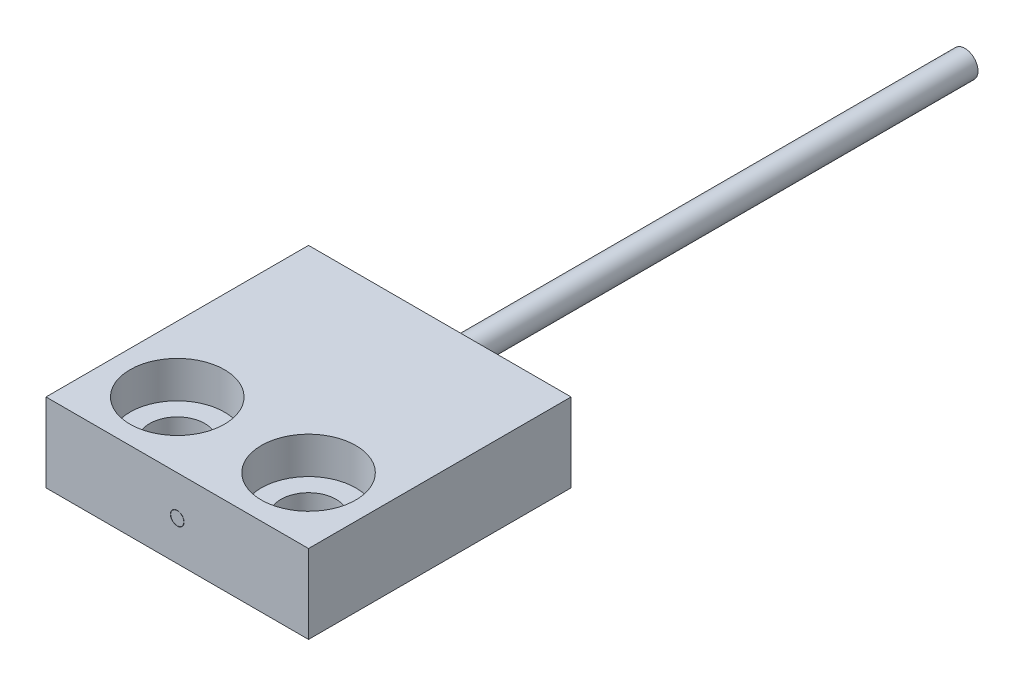
ISO-10303-21;
HEADER;
FILE_DESCRIPTION(('STEP AP214'),'2;1');
FILE_NAME('part.step','',(''),(''),'','','');
FILE_SCHEMA(('AUTOMOTIVE_DESIGN { 1 0 10303 214 1 1 1 1 }'));
ENDSEC;
DATA;
#1=APPLICATION_CONTEXT('core data for automotive mechanical design processes');
#2=APPLICATION_PROTOCOL_DEFINITION('international standard','automotive_design',2000,#1);
#3=PRODUCT_CONTEXT('',#1,'mechanical');
#4=PRODUCT('Part','Part','',(#3));
#5=PRODUCT_RELATED_PRODUCT_CATEGORY('part','',(#4));
#6=PRODUCT_DEFINITION_FORMATION('','',#4);
#7=PRODUCT_DEFINITION_CONTEXT('part definition',#1,'design');
#8=PRODUCT_DEFINITION('design','',#6,#7);
#9=PRODUCT_DEFINITION_SHAPE('','',#8);
#10=(LENGTH_UNIT() NAMED_UNIT(*) SI_UNIT(.MILLI.,.METRE.));
#11=(NAMED_UNIT(*) PLANE_ANGLE_UNIT() SI_UNIT($,.RADIAN.));
#12=(NAMED_UNIT(*) SI_UNIT($,.STERADIAN.) SOLID_ANGLE_UNIT());
#13=UNCERTAINTY_MEASURE_WITH_UNIT(LENGTH_MEASURE(1.E-05),#10,'distance_accuracy_value','');
#14=(GEOMETRIC_REPRESENTATION_CONTEXT(3) GLOBAL_UNCERTAINTY_ASSIGNED_CONTEXT((#13)) GLOBAL_UNIT_ASSIGNED_CONTEXT((#10,
#11,#12)) REPRESENTATION_CONTEXT('',''));
#15=CARTESIAN_POINT('',(0.,0.,0.));
#16=DIRECTION('',(0.,0.,1.));
#17=DIRECTION('',(1.,0.,0.));
#18=AXIS2_PLACEMENT_3D('',#15,#16,#17);
#19=CARTESIAN_POINT('',(-10.,1.50000000000004,0.));
#20=DIRECTION('',(0.,0.,1.));
#21=DIRECTION('',(0.,-1.,0.));
#22=AXIS2_PLACEMENT_3D('',#19,#20,#21);
#23=PLANE('',#22);
#24=CARTESIAN_POINT('',(-15.,0.,0.));
#25=DIRECTION('',(0.,0.,1.));
#26=DIRECTION('',(1.,0.,0.));
#27=AXIS2_PLACEMENT_3D('',#24,#25,#26);
#28=CIRCLE('',#27,0.25);
#29=CARTESIAN_POINT('',(-14.75,0.,0.));
#30=VERTEX_POINT('',#29);
#31=EDGE_CURVE('E21',#30,#30,#28,.F.);
#32=ORIENTED_EDGE('',*,*,#31,.F.);
#33=EDGE_LOOP('',(#32));
#34=FACE_BOUND('',#33,.T.);
#35=ADVANCED_FACE('F17',(#34),#23,.T.);
#36=CARTESIAN_POINT('',(-15.,0.,-10.735391052434));
#37=DIRECTION('',(0.,0.,1.));
#38=DIRECTION('',(1.,0.,0.));
#39=AXIS2_PLACEMENT_3D('',#36,#37,#38);
#40=CYLINDRICAL_SURFACE('',#39,0.25);
#41=ORIENTED_EDGE('',*,*,#31,.T.);
#42=EDGE_LOOP('',(#41));
#43=FACE_BOUND('',#42,.T.);
#44=CARTESIAN_POINT('',(-15.,0.,-10.));
#45=DIRECTION('',(0.,0.,1.));
#46=DIRECTION('',(1.,0.,0.));
#47=AXIS2_PLACEMENT_3D('',#44,#45,#46);
#48=CIRCLE('',#47,0.25);
#49=CARTESIAN_POINT('',(-14.75,0.,-10.));
#50=VERTEX_POINT('',#49);
#51=EDGE_CURVE('E128',#50,#50,#48,.T.);
#52=ORIENTED_EDGE('',*,*,#51,.T.);
#53=EDGE_LOOP('',(#52));
#54=FACE_BOUND('',#53,.T.);
#55=ADVANCED_FACE('F135',(#43,#54),#40,.T.);
#56=CARTESIAN_POINT('',(-20.,1.49999999999994,-10.));
#57=DIRECTION('',(0.,0.,-1.));
#58=DIRECTION('',(0.,1.,0.));
#59=AXIS2_PLACEMENT_3D('',#56,#57,#58);
#60=PLANE('',#59);
#61=CARTESIAN_POINT('',(-15.,0.,-10.));
#62=DIRECTION('',(0.,0.,1.));
#63=DIRECTION('',(1.,0.,0.));
#64=AXIS2_PLACEMENT_3D('',#61,#62,#63);
#65=CIRCLE('',#64,0.26);
#66=CARTESIAN_POINT('',(-14.74,0.,-10.));
#67=VERTEX_POINT('',#66);
#68=EDGE_CURVE('E123',#67,#67,#65,.T.);
#69=ORIENTED_EDGE('',*,*,#68,.T.);
#70=EDGE_LOOP('',(#69));
#71=FACE_BOUND('',#70,.T.);
#72=ORIENTED_EDGE('',*,*,#51,.F.);
#73=EDGE_LOOP('',(#72));
#74=FACE_BOUND('',#73,.T.);
#75=ADVANCED_FACE('F143',(#71,#74),#60,.F.);
#76=CARTESIAN_POINT('',(-12.5,0.100000000000017,-2.5));
#77=DIRECTION('',(0.,1.,0.));
#78=DIRECTION('',(-1.,0.,0.));
#79=AXIS2_PLACEMENT_3D('',#76,#77,#78);
#80=CYLINDRICAL_SURFACE('',#79,1.8);
#81=CARTESIAN_POINT('',(-12.5,0.100000000000017,-2.5));
#82=DIRECTION('',(0.,1.,0.));
#83=DIRECTION('',(-1.,0.,0.));
#84=AXIS2_PLACEMENT_3D('',#81,#82,#83);
#85=CIRCLE('',#84,1.8);
#86=CARTESIAN_POINT('',(-14.3,0.100000000000005,-2.5));
#87=VERTEX_POINT('',#86);
#88=EDGE_CURVE('E126',#87,#87,#85,.T.);
#89=ORIENTED_EDGE('',*,*,#88,.F.);
#90=EDGE_LOOP('',(#89));
#91=FACE_BOUND('',#90,.T.);
#92=CARTESIAN_POINT('',(-12.5,1.50000000000002,-2.50000000000001));
#93=DIRECTION('',(0.,1.,0.));
#94=DIRECTION('',(-1.,0.,0.));
#95=AXIS2_PLACEMENT_3D('',#92,#93,#94);
#96=CIRCLE('',#95,1.8);
#97=CARTESIAN_POINT('',(-14.3,1.50000000000001,-2.50000000000001));
#98=VERTEX_POINT('',#97);
#99=EDGE_CURVE('E117',#98,#98,#96,.T.);
#100=ORIENTED_EDGE('',*,*,#99,.T.);
#101=EDGE_LOOP('',(#100));
#102=FACE_BOUND('',#101,.T.);
#103=ADVANCED_FACE('F210',(#91,#102),#80,.F.);
#104=CARTESIAN_POINT('',(-15.,-1.04744500833281E-13,-30.));
#105=DIRECTION('',(0.,0.,-1.));
#106=DIRECTION('',(0.,1.,0.));
#107=AXIS2_PLACEMENT_3D('',#104,#105,#106);
#108=PLANE('',#107);
#109=CARTESIAN_POINT('',(-15.,0.,-30.));
#110=DIRECTION('',(0.,0.,1.));
#111=DIRECTION('',(0.,-1.,0.));
#112=AXIS2_PLACEMENT_3D('',#109,#110,#111);
#113=CIRCLE('',#112,0.5);
#114=CARTESIAN_POINT('',(-15.,-0.500000000000096,-30.));
#115=VERTEX_POINT('',#114);
#116=EDGE_CURVE('E114',#115,#115,#113,.T.);
#117=ORIENTED_EDGE('',*,*,#116,.F.);
#118=EDGE_LOOP('',(#117));
#119=FACE_BOUND('',#118,.T.);
#120=ADVANCED_FACE('F206',(#119),#108,.T.);
#121=CARTESIAN_POINT('',(-17.5,0.0999999999999824,-2.5));
#122=DIRECTION('',(0.,1.,0.));
#123=DIRECTION('',(-1.,0.,0.));
#124=AXIS2_PLACEMENT_3D('',#121,#122,#123);
#125=CYLINDRICAL_SURFACE('',#124,1.8);
#126=CARTESIAN_POINT('',(-17.5,1.49999999999998,-2.50000000000001));
#127=DIRECTION('',(0.,1.,0.));
#128=DIRECTION('',(-1.,0.,0.));
#129=AXIS2_PLACEMENT_3D('',#126,#127,#128);
#130=CIRCLE('',#129,1.8);
#131=CARTESIAN_POINT('',(-19.3,1.49999999999997,-2.50000000000001));
#132=VERTEX_POINT('',#131);
#133=EDGE_CURVE('E120',#132,#132,#130,.T.);
#134=ORIENTED_EDGE('',*,*,#133,.T.);
#135=EDGE_LOOP('',(#134));
#136=FACE_BOUND('',#135,.T.);
#137=CARTESIAN_POINT('',(-17.5,0.0999999999999824,-2.5));
#138=DIRECTION('',(0.,1.,0.));
#139=DIRECTION('',(-1.,0.,0.));
#140=AXIS2_PLACEMENT_3D('',#137,#138,#139);
#141=CIRCLE('',#140,1.8);
#142=CARTESIAN_POINT('',(-19.3,0.0999999999999699,-2.5));
#143=VERTEX_POINT('',#142);
#144=EDGE_CURVE('E111',#143,#143,#141,.T.);
#145=ORIENTED_EDGE('',*,*,#144,.F.);
#146=EDGE_LOOP('',(#145));
#147=FACE_BOUND('',#146,.T.);
#148=ADVANCED_FACE('F202',(#136,#147),#125,.F.);
#149=CARTESIAN_POINT('',(-12.5,0.100000000000017,-2.5));
#150=DIRECTION('',(0.,1.,0.));
#151=DIRECTION('',(-1.,0.,0.));
#152=AXIS2_PLACEMENT_3D('',#149,#150,#151);
#153=PLANE('',#152);
#154=CARTESIAN_POINT('',(-12.5,0.100000000000017,-2.5));
#155=DIRECTION('',(0.,-1.,0.));
#156=DIRECTION('',(1.,0.,0.));
#157=AXIS2_PLACEMENT_3D('',#154,#155,#156);
#158=CIRCLE('',#157,1.05);
#159=CARTESIAN_POINT('',(-11.45,0.100000000000025,-2.5));
#160=VERTEX_POINT('',#159);
#161=EDGE_CURVE('E77',#160,#160,#158,.T.);
#162=ORIENTED_EDGE('',*,*,#161,.T.);
#163=EDGE_LOOP('',(#162));
#164=FACE_BOUND('',#163,.T.);
#165=ORIENTED_EDGE('',*,*,#88,.T.);
#166=EDGE_LOOP('',(#165));
#167=FACE_BOUND('',#166,.T.);
#168=ADVANCED_FACE('F198',(#164,#167),#153,.T.);
#169=CARTESIAN_POINT('',(-15.,0.,-10.735391052434));
#170=DIRECTION('',(0.,0.,1.));
#171=DIRECTION('',(1.,0.,0.));
#172=AXIS2_PLACEMENT_3D('',#169,#170,#171);
#173=CYLINDRICAL_SURFACE('',#172,0.26);
#174=ORIENTED_EDGE('',*,*,#68,.F.);
#175=EDGE_LOOP('',(#174));
#176=FACE_BOUND('',#175,.T.);
#177=CARTESIAN_POINT('',(-15.,0.,0.));
#178=DIRECTION('',(0.,0.,1.));
#179=DIRECTION('',(1.,0.,0.));
#180=AXIS2_PLACEMENT_3D('',#177,#178,#179);
#181=CIRCLE('',#180,0.26);
#182=CARTESIAN_POINT('',(-14.74,0.,0.));
#183=VERTEX_POINT('',#182);
#184=EDGE_CURVE('E82',#183,#183,#181,.F.);
#185=ORIENTED_EDGE('',*,*,#184,.F.);
#186=EDGE_LOOP('',(#185));
#187=FACE_BOUND('',#186,.T.);
#188=ADVANCED_FACE('F192',(#176,#187),#173,.F.);
#189=CARTESIAN_POINT('',(-20.,1.49999999999994,-10.));
#190=DIRECTION('',(0.,-1.,0.));
#191=DIRECTION('',(1.,0.,0.));
#192=AXIS2_PLACEMENT_3D('',#189,#190,#191);
#193=PLANE('',#192);
#194=ORIENTED_EDGE('',*,*,#99,.F.);
#195=EDGE_LOOP('',(#194));
#196=FACE_BOUND('',#195,.T.);
#197=ORIENTED_EDGE('',*,*,#133,.F.);
#198=EDGE_LOOP('',(#197));
#199=FACE_BOUND('',#198,.T.);
#200=DIRECTION('',(0.,0.,1.));
#201=VECTOR('',#200,1.);
#202=CARTESIAN_POINT('',(-10.,1.49999999999999,-10.));
#203=LINE('',#202,#201);
#204=CARTESIAN_POINT('',(-10.,1.49999999999999,-10.));
#205=VERTEX_POINT('',#204);
#206=CARTESIAN_POINT('',(-10.,1.50000000000003,0.));
#207=VERTEX_POINT('',#206);
#208=EDGE_CURVE('E57',#205,#207,#203,.T.);
#209=ORIENTED_EDGE('',*,*,#208,.F.);
#210=DIRECTION('',(1.,0.,0.));
#211=VECTOR('',#210,1.);
#212=CARTESIAN_POINT('',(-20.,1.49999999999996,-10.));
#213=LINE('',#212,#211);
#214=CARTESIAN_POINT('',(-20.,1.49999999999995,-10.));
#215=VERTEX_POINT('',#214);
#216=EDGE_CURVE('E61',#215,#205,#213,.T.);
#217=ORIENTED_EDGE('',*,*,#216,.F.);
#218=DIRECTION('',(0.,0.,1.));
#219=VECTOR('',#218,1.);
#220=CARTESIAN_POINT('',(-20.,1.49999999999998,0.));
#221=LINE('',#220,#219);
#222=CARTESIAN_POINT('',(-20.,1.49999999999999,0.));
#223=VERTEX_POINT('',#222);
#224=EDGE_CURVE('E68',#223,#215,#221,.F.);
#225=ORIENTED_EDGE('',*,*,#224,.F.);
#226=DIRECTION('',(1.,0.,0.));
#227=VECTOR('',#226,1.);
#228=CARTESIAN_POINT('',(-10.,1.50000000000003,0.));
#229=LINE('',#228,#227);
#230=EDGE_CURVE('E66',#207,#223,#229,.F.);
#231=ORIENTED_EDGE('',*,*,#230,.F.);
#232=EDGE_LOOP('',(#209,#217,#225,#231));
#233=FACE_BOUND('',#232,.T.);
#234=ADVANCED_FACE('F67',(#196,#199,#233),#193,.F.);
#235=CARTESIAN_POINT('',(-15.,-3.75334461319259E-13,-110.));
#236=DIRECTION('',(0.,0.,1.));
#237=DIRECTION('',(0.,-1.,0.));
#238=AXIS2_PLACEMENT_3D('',#235,#236,#237);
#239=CYLINDRICAL_SURFACE('',#238,0.5);
#240=ORIENTED_EDGE('',*,*,#116,.T.);
#241=EDGE_LOOP('',(#240));
#242=FACE_BOUND('',#241,.T.);
#243=CARTESIAN_POINT('',(-15.,0.,-9.99999999999999));
#244=DIRECTION('',(0.,0.,1.));
#245=DIRECTION('',(0.,-1.,0.));
#246=AXIS2_PLACEMENT_3D('',#243,#244,#245);
#247=CIRCLE('',#246,0.5);
#248=CARTESIAN_POINT('',(-15.,-0.500000000000026,-9.99999999999999));
#249=VERTEX_POINT('',#248);
#250=EDGE_CURVE('E91',#249,#249,#247,.T.);
#251=ORIENTED_EDGE('',*,*,#250,.F.);
#252=EDGE_LOOP('',(#251));
#253=FACE_BOUND('',#252,.T.);
#254=ADVANCED_FACE('F168',(#242,#253),#239,.T.);
#255=CARTESIAN_POINT('',(-17.5,0.0999999999999824,-2.5));
#256=DIRECTION('',(0.,1.,0.));
#257=DIRECTION('',(-1.,0.,0.));
#258=AXIS2_PLACEMENT_3D('',#255,#256,#257);
#259=PLANE('',#258);
#260=CARTESIAN_POINT('',(-17.5,0.0999999999999825,-2.5));
#261=DIRECTION('',(0.,-1.,0.));
#262=DIRECTION('',(1.,0.,0.));
#263=AXIS2_PLACEMENT_3D('',#260,#261,#262);
#264=CIRCLE('',#263,1.05);
#265=CARTESIAN_POINT('',(-16.45,0.0999999999999898,-2.5));
#266=VERTEX_POINT('',#265);
#267=EDGE_CURVE('E104',#266,#266,#264,.T.);
#268=ORIENTED_EDGE('',*,*,#267,.T.);
#269=EDGE_LOOP('',(#268));
#270=FACE_BOUND('',#269,.T.);
#271=ORIENTED_EDGE('',*,*,#144,.T.);
#272=EDGE_LOOP('',(#271));
#273=FACE_BOUND('',#272,.T.);
#274=ADVANCED_FACE('F160',(#270,#273),#259,.T.);
#275=CARTESIAN_POINT('',(-12.5,1.50000000000002,-2.50000000000001));
#276=DIRECTION('',(0.,-1.,0.));
#277=DIRECTION('',(1.,0.,0.));
#278=AXIS2_PLACEMENT_3D('',#275,#276,#277);
#279=CYLINDRICAL_SURFACE('',#278,1.05);
#280=ORIENTED_EDGE('',*,*,#161,.F.);
#281=EDGE_LOOP('',(#280));
#282=FACE_BOUND('',#281,.T.);
#283=CARTESIAN_POINT('',(-12.5,-1.49999999999998,-2.49999999999999));
#284=DIRECTION('',(0.,-1.,0.));
#285=DIRECTION('',(1.,0.,0.));
#286=AXIS2_PLACEMENT_3D('',#283,#284,#285);
#287=CIRCLE('',#286,1.05);
#288=CARTESIAN_POINT('',(-11.45,-1.49999999999998,-2.49999999999999));
#289=VERTEX_POINT('',#288);
#290=EDGE_CURVE('E100',#289,#289,#287,.F.);
#291=ORIENTED_EDGE('',*,*,#290,.F.);
#292=EDGE_LOOP('',(#291));
#293=FACE_BOUND('',#292,.T.);
#294=ADVANCED_FACE('F158',(#282,#293),#279,.F.);
#295=CARTESIAN_POINT('',(-10.,1.50000000000001,-10.));
#296=DIRECTION('',(1.,0.,0.));
#297=DIRECTION('',(0.,1.,0.));
#298=AXIS2_PLACEMENT_3D('',#295,#296,#297);
#299=PLANE('',#298);
#300=DIRECTION('',(0.,0.,1.));
#301=VECTOR('',#300,1.);
#302=CARTESIAN_POINT('',(-9.99999999999999,-1.49999999999999,-9.99999999999999));
#303=LINE('',#302,#301);
#304=CARTESIAN_POINT('',(-9.99999999999999,-1.49999999999998,-10.));
#305=VERTEX_POINT('',#304);
#306=CARTESIAN_POINT('',(-9.99999999999999,-1.49999999999998,0.));
#307=VERTEX_POINT('',#306);
#308=EDGE_CURVE('E49',#305,#307,#303,.T.);
#309=ORIENTED_EDGE('',*,*,#308,.F.);
#310=DIRECTION('',(0.,1.,0.));
#311=VECTOR('',#310,1.);
#312=CARTESIAN_POINT('',(-10.,1.49999999999994,-10.));
#313=LINE('',#312,#311);
#314=EDGE_CURVE('E76',#205,#305,#313,.F.);
#315=ORIENTED_EDGE('',*,*,#314,.F.);
#316=ORIENTED_EDGE('',*,*,#208,.T.);
#317=DIRECTION('',(0.,-1.,0.));
#318=VECTOR('',#317,1.);
#319=CARTESIAN_POINT('',(-9.99999999999999,1.50000000000004,0.));
#320=LINE('',#319,#318);
#321=EDGE_CURVE('E72',#307,#207,#320,.F.);
#322=ORIENTED_EDGE('',*,*,#321,.F.);
#323=EDGE_LOOP('',(#309,#315,#316,#322));
#324=FACE_BOUND('',#323,.T.);
#325=ADVANCED_FACE('F74',(#324),#299,.T.);
#326=CARTESIAN_POINT('',(-10.,1.50000000000004,0.));
#327=DIRECTION('',(0.,0.,1.));
#328=DIRECTION('',(0.,-1.,0.));
#329=AXIS2_PLACEMENT_3D('',#326,#327,#328);
#330=PLANE('',#329);
#331=ORIENTED_EDGE('',*,*,#184,.T.);
#332=EDGE_LOOP('',(#331));
#333=FACE_BOUND('',#332,.T.);
#334=DIRECTION('',(1.,0.,0.));
#335=VECTOR('',#334,1.);
#336=CARTESIAN_POINT('',(-20.,-1.50000000000003,0.));
#337=LINE('',#336,#335);
#338=CARTESIAN_POINT('',(-20.,-1.50000000000004,0.));
#339=VERTEX_POINT('',#338);
#340=EDGE_CURVE('E81',#307,#339,#337,.F.);
#341=ORIENTED_EDGE('',*,*,#340,.F.);
#342=ORIENTED_EDGE('',*,*,#321,.T.);
#343=ORIENTED_EDGE('',*,*,#230,.T.);
#344=DIRECTION('',(0.,-1.,0.));
#345=VECTOR('',#344,1.);
#346=CARTESIAN_POINT('',(-20.,1.49999999999997,0.));
#347=LINE('',#346,#345);
#348=EDGE_CURVE('E87',#339,#223,#347,.F.);
#349=ORIENTED_EDGE('',*,*,#348,.F.);
#350=EDGE_LOOP('',(#341,#342,#343,#349));
#351=FACE_BOUND('',#350,.T.);
#352=ADVANCED_FACE('F79',(#333,#351),#330,.T.);
#353=CARTESIAN_POINT('',(-20.,1.49999999999997,0.));
#354=DIRECTION('',(-1.,0.,0.));
#355=DIRECTION('',(0.,-1.,0.));
#356=AXIS2_PLACEMENT_3D('',#353,#354,#355);
#357=PLANE('',#356);
#358=DIRECTION('',(0.,0.,1.));
#359=VECTOR('',#358,1.);
#360=CARTESIAN_POINT('',(-20.,-1.50000000000006,-9.99999999999999));
#361=LINE('',#360,#359);
#362=CARTESIAN_POINT('',(-20.,-1.50000000000004,-10.));
#363=VERTEX_POINT('',#362);
#364=EDGE_CURVE('E96',#339,#363,#361,.F.);
#365=ORIENTED_EDGE('',*,*,#364,.F.);
#366=ORIENTED_EDGE('',*,*,#348,.T.);
#367=ORIENTED_EDGE('',*,*,#224,.T.);
#368=DIRECTION('',(0.,1.,0.));
#369=VECTOR('',#368,1.);
#370=CARTESIAN_POINT('',(-20.,1.49999999999994,-10.));
#371=LINE('',#370,#369);
#372=EDGE_CURVE('E36',#363,#215,#371,.T.);
#373=ORIENTED_EDGE('',*,*,#372,.F.);
#374=EDGE_LOOP('',(#365,#366,#367,#373));
#375=FACE_BOUND('',#374,.T.);
#376=ADVANCED_FACE('F176',(#375),#357,.T.);
#377=CARTESIAN_POINT('',(-20.,1.49999999999994,-10.));
#378=DIRECTION('',(0.,0.,-1.));
#379=DIRECTION('',(0.,1.,0.));
#380=AXIS2_PLACEMENT_3D('',#377,#378,#379);
#381=PLANE('',#380);
#382=ORIENTED_EDGE('',*,*,#250,.T.);
#383=EDGE_LOOP('',(#382));
#384=FACE_BOUND('',#383,.T.);
#385=DIRECTION('',(1.,0.,0.));
#386=VECTOR('',#385,1.);
#387=CARTESIAN_POINT('',(-20.,-1.50000000000006,-10.));
#388=LINE('',#387,#386);
#389=EDGE_CURVE('E27',#363,#305,#388,.T.);
#390=ORIENTED_EDGE('',*,*,#389,.F.);
#391=ORIENTED_EDGE('',*,*,#372,.T.);
#392=ORIENTED_EDGE('',*,*,#216,.T.);
#393=ORIENTED_EDGE('',*,*,#314,.T.);
#394=EDGE_LOOP('',(#390,#391,#392,#393));
#395=FACE_BOUND('',#394,.T.);
#396=ADVANCED_FACE('F151',(#384,#395),#381,.T.);
#397=CARTESIAN_POINT('',(-17.5,1.49999999999998,-2.50000000000001));
#398=DIRECTION('',(0.,-1.,0.));
#399=DIRECTION('',(1.,0.,0.));
#400=AXIS2_PLACEMENT_3D('',#397,#398,#399);
#401=CYLINDRICAL_SURFACE('',#400,1.05);
#402=ORIENTED_EDGE('',*,*,#267,.F.);
#403=EDGE_LOOP('',(#402));
#404=FACE_BOUND('',#403,.T.);
#405=CARTESIAN_POINT('',(-17.5,-1.50000000000002,-2.49999999999999));
#406=DIRECTION('',(0.,-1.,0.));
#407=DIRECTION('',(1.,0.,0.));
#408=AXIS2_PLACEMENT_3D('',#405,#406,#407);
#409=CIRCLE('',#408,1.05);
#410=CARTESIAN_POINT('',(-16.45,-1.50000000000001,-2.49999999999999));
#411=VERTEX_POINT('',#410);
#412=EDGE_CURVE('E11',#411,#411,#409,.F.);
#413=ORIENTED_EDGE('',*,*,#412,.F.);
#414=EDGE_LOOP('',(#413));
#415=FACE_BOUND('',#414,.T.);
#416=ADVANCED_FACE('F146',(#404,#415),#401,.F.);
#417=CARTESIAN_POINT('',(-20.,-1.50000000000006,-9.99999999999999));
#418=DIRECTION('',(0.,-1.,0.));
#419=DIRECTION('',(1.,0.,0.));
#420=AXIS2_PLACEMENT_3D('',#417,#418,#419);
#421=PLANE('',#420);
#422=ORIENTED_EDGE('',*,*,#412,.T.);
#423=EDGE_LOOP('',(#422));
#424=FACE_BOUND('',#423,.T.);
#425=ORIENTED_EDGE('',*,*,#364,.T.);
#426=ORIENTED_EDGE('',*,*,#389,.T.);
#427=ORIENTED_EDGE('',*,*,#308,.T.);
#428=ORIENTED_EDGE('',*,*,#340,.T.);
#429=EDGE_LOOP('',(#425,#426,#427,#428));
#430=FACE_BOUND('',#429,.T.);
#431=ORIENTED_EDGE('',*,*,#290,.T.);
#432=EDGE_LOOP('',(#431));
#433=FACE_BOUND('',#432,.T.);
#434=ADVANCED_FACE('F19',(#424,#430,#433),#421,.T.);
#435=CLOSED_SHELL('',(#35,#55,#75,#103,#120,#148,#168,#188,#234,#254,#274,#294,#325,#352,#376,
#396,#416,#434));
#436=MANIFOLD_SOLID_BREP('B1',#435);
#437=ADVANCED_BREP_SHAPE_REPRESENTATION('',(#18,#436),#14);
#438=SHAPE_DEFINITION_REPRESENTATION(#9,#437);
ENDSEC;
END-ISO-10303-21;
